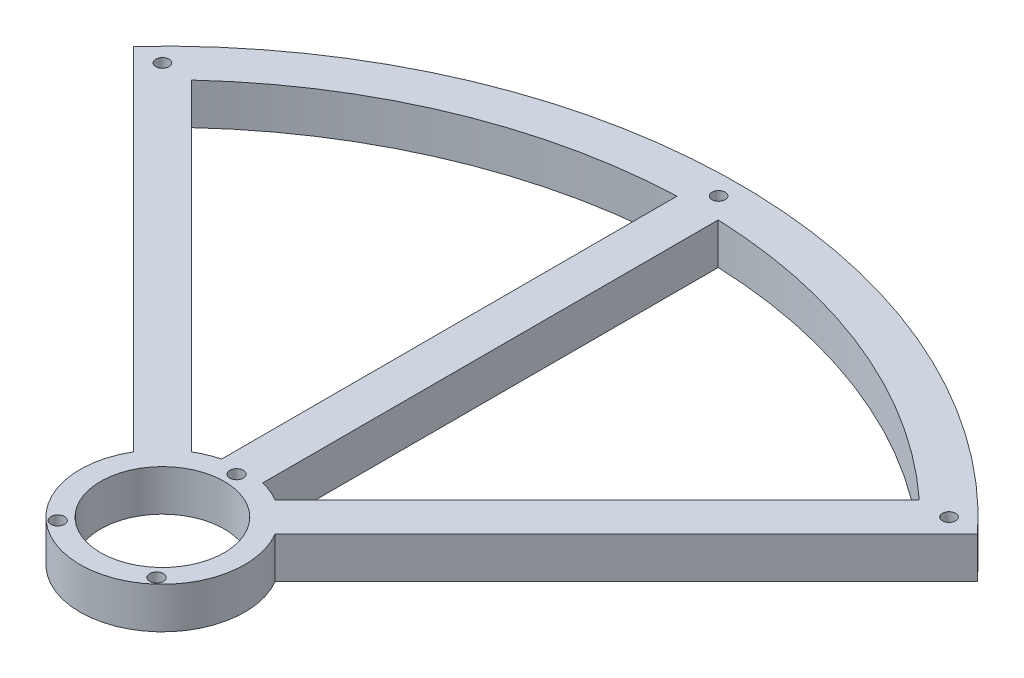
ISO-10303-21;
HEADER;
FILE_DESCRIPTION(('STEP AP214'),'2;1');
FILE_NAME('part.step','',(''),(''),'','','');
FILE_SCHEMA(('AUTOMOTIVE_DESIGN { 1 0 10303 214 1 1 1 1 }'));
ENDSEC;
DATA;
#1=APPLICATION_CONTEXT('core data for automotive mechanical design processes');
#2=APPLICATION_PROTOCOL_DEFINITION('international standard','automotive_design',2000,#1);
#3=PRODUCT_CONTEXT('',#1,'mechanical');
#4=PRODUCT('Part','Part','',(#3));
#5=PRODUCT_RELATED_PRODUCT_CATEGORY('part','',(#4));
#6=PRODUCT_DEFINITION_FORMATION('','',#4);
#7=PRODUCT_DEFINITION_CONTEXT('part definition',#1,'design');
#8=PRODUCT_DEFINITION('design','',#6,#7);
#9=PRODUCT_DEFINITION_SHAPE('','',#8);
#10=(LENGTH_UNIT() NAMED_UNIT(*) SI_UNIT(.MILLI.,.METRE.));
#11=(NAMED_UNIT(*) PLANE_ANGLE_UNIT() SI_UNIT($,.RADIAN.));
#12=(NAMED_UNIT(*) SI_UNIT($,.STERADIAN.) SOLID_ANGLE_UNIT());
#13=UNCERTAINTY_MEASURE_WITH_UNIT(LENGTH_MEASURE(1.E-05),#10,'distance_accuracy_value','');
#14=(GEOMETRIC_REPRESENTATION_CONTEXT(3) GLOBAL_UNCERTAINTY_ASSIGNED_CONTEXT((#13)) GLOBAL_UNIT_ASSIGNED_CONTEXT((#10,
#11,#12)) REPRESENTATION_CONTEXT('',''));
#15=CARTESIAN_POINT('',(0.,0.,0.));
#16=DIRECTION('',(0.,0.,1.));
#17=DIRECTION('',(1.,0.,0.));
#18=AXIS2_PLACEMENT_3D('',#15,#16,#17);
#19=CARTESIAN_POINT('',(0.,10.,0.));
#20=DIRECTION('',(0.,-1.,0.));
#21=DIRECTION('',(0.,0.,-1.));
#22=AXIS2_PLACEMENT_3D('',#19,#20,#21);
#23=CYLINDRICAL_SURFACE('',#22,20.);
#24=CARTESIAN_POINT('',(0.,0.,0.));
#25=DIRECTION('',(0.,1.,0.));
#26=DIRECTION('',(0.,0.,1.));
#27=AXIS2_PLACEMENT_3D('',#24,#25,#26);
#28=CIRCLE('',#27,20.);
#29=CARTESIAN_POINT('',(-17.2285978435619,0.,-10.1575300316964));
#30=VERTEX_POINT('',#29);
#31=CARTESIAN_POINT('',(17.2285978435619,0.,-10.1575300316964));
#32=VERTEX_POINT('',#31);
#33=EDGE_CURVE('E169',#30,#32,#28,.T.);
#34=ORIENTED_EDGE('',*,*,#33,.T.);
#35=DIRECTION('',(0.,-1.,0.));
#36=VECTOR('',#35,1.);
#37=CARTESIAN_POINT('',(17.2285978435619,10.,-10.1575300316964));
#38=LINE('',#37,#36);
#39=CARTESIAN_POINT('',(17.2285978435619,10.,-10.1575300316964));
#40=VERTEX_POINT('',#39);
#41=EDGE_CURVE('E11',#40,#32,#38,.T.);
#42=ORIENTED_EDGE('',*,*,#41,.F.);
#43=CARTESIAN_POINT('',(0.,10.,0.));
#44=DIRECTION('',(0.,1.,0.));
#45=DIRECTION('',(0.,0.,1.));
#46=AXIS2_PLACEMENT_3D('',#43,#44,#45);
#47=CIRCLE('',#46,20.);
#48=CARTESIAN_POINT('',(-17.2285978435619,10.,-10.1575300316964));
#49=VERTEX_POINT('',#48);
#50=EDGE_CURVE('E138',#49,#40,#47,.T.);
#51=ORIENTED_EDGE('',*,*,#50,.F.);
#52=DIRECTION('',(0.,-1.,0.));
#53=VECTOR('',#52,1.);
#54=CARTESIAN_POINT('',(-17.2285978435619,10.,-10.1575300316964));
#55=LINE('',#54,#53);
#56=EDGE_CURVE('E192',#49,#30,#55,.T.);
#57=ORIENTED_EDGE('',*,*,#56,.T.);
#58=EDGE_LOOP('',(#34,#42,#51,#57));
#59=FACE_BOUND('',#58,.T.);
#60=ADVANCED_FACE('F37',(#59),#23,.T.);
#61=CARTESIAN_POINT('',(3.53553390593275,10.,3.53553390593276));
#62=DIRECTION('',(-0.707106781186546,0.,-0.707106781186549));
#63=DIRECTION('',(-0.707106781186549,0.,0.707106781186546));
#64=AXIS2_PLACEMENT_3D('',#61,#62,#63);
#65=PLANE('',#64);
#66=DIRECTION('',(0.707106781186549,0.,-0.707106781186546));
#67=VECTOR('',#66,1.);
#68=CARTESIAN_POINT('',(3.53553390593275,0.,3.53553390593276));
#69=LINE('',#68,#67);
#70=CARTESIAN_POINT('',(102.46732859298,0.,-95.396260781114));
#71=VERTEX_POINT('',#70);
#72=EDGE_CURVE('E144',#32,#71,#69,.T.);
#73=ORIENTED_EDGE('',*,*,#72,.T.);
#74=DIRECTION('',(0.,-1.,0.));
#75=VECTOR('',#74,1.);
#76=CARTESIAN_POINT('',(102.46732859298,10.,-95.396260781114));
#77=LINE('',#76,#75);
#78=CARTESIAN_POINT('',(102.46732859298,10.,-95.396260781114));
#79=VERTEX_POINT('',#78);
#80=EDGE_CURVE('E47',#79,#71,#77,.T.);
#81=ORIENTED_EDGE('',*,*,#80,.F.);
#82=DIRECTION('',(0.707106781186549,0.,-0.707106781186546));
#83=VECTOR('',#82,1.);
#84=CARTESIAN_POINT('',(3.53553390593275,10.,3.53553390593276));
#85=LINE('',#84,#83);
#86=EDGE_CURVE('E132',#40,#79,#85,.T.);
#87=ORIENTED_EDGE('',*,*,#86,.F.);
#88=ORIENTED_EDGE('',*,*,#41,.T.);
#89=EDGE_LOOP('',(#73,#81,#87,#88));
#90=FACE_BOUND('',#89,.T.);
#91=ADVANCED_FACE('F143',(#90),#65,.F.);
#92=CARTESIAN_POINT('',(0.,10.,0.));
#93=DIRECTION('',(0.,-1.,0.));
#94=DIRECTION('',(0.,0.,-1.));
#95=AXIS2_PLACEMENT_3D('',#92,#93,#94);
#96=CYLINDRICAL_SURFACE('',#95,140.);
#97=CARTESIAN_POINT('',(0.,0.,0.));
#98=DIRECTION('',(0.,1.,0.));
#99=DIRECTION('',(0.,0.,1.));
#100=AXIS2_PLACEMENT_3D('',#97,#98,#99);
#101=CIRCLE('',#100,140.);
#102=CARTESIAN_POINT('',(-102.46732859298,0.,-95.396260781114));
#103=VERTEX_POINT('',#102);
#104=EDGE_CURVE('E188',#103,#71,#101,.F.);
#105=ORIENTED_EDGE('',*,*,#104,.F.);
#106=DIRECTION('',(0.,-1.,0.));
#107=VECTOR('',#106,1.);
#108=CARTESIAN_POINT('',(-102.46732859298,10.,-95.396260781114));
#109=LINE('',#108,#107);
#110=CARTESIAN_POINT('',(-102.46732859298,10.,-95.396260781114));
#111=VERTEX_POINT('',#110);
#112=EDGE_CURVE('E96',#111,#103,#109,.T.);
#113=ORIENTED_EDGE('',*,*,#112,.F.);
#114=CARTESIAN_POINT('',(0.,10.,0.));
#115=DIRECTION('',(0.,1.,0.));
#116=DIRECTION('',(0.,0.,1.));
#117=AXIS2_PLACEMENT_3D('',#114,#115,#116);
#118=CIRCLE('',#117,140.);
#119=EDGE_CURVE('E136',#111,#79,#118,.F.);
#120=ORIENTED_EDGE('',*,*,#119,.T.);
#121=ORIENTED_EDGE('',*,*,#80,.T.);
#122=EDGE_LOOP('',(#105,#113,#120,#121));
#123=FACE_BOUND('',#122,.T.);
#124=ADVANCED_FACE('F149',(#123),#96,.T.);
#125=CARTESIAN_POINT('',(0.,10.,0.));
#126=DIRECTION('',(0.,-1.,0.));
#127=DIRECTION('',(0.,0.,-1.));
#128=AXIS2_PLACEMENT_3D('',#125,#126,#127);
#129=CYLINDRICAL_SURFACE('',#128,130.);
#130=CARTESIAN_POINT('',(0.,0.,0.));
#131=DIRECTION('',(0.,1.,0.));
#132=DIRECTION('',(0.,0.,1.));
#133=AXIS2_PLACEMENT_3D('',#130,#131,#132);
#134=CIRCLE('',#133,130.);
#135=CARTESIAN_POINT('',(-88.3203314484366,0.,-95.3913992603018));
#136=VERTEX_POINT('',#135);
#137=CARTESIAN_POINT('',(-5.,0.,-129.903810567666));
#138=VERTEX_POINT('',#137);
#139=EDGE_CURVE('E163',#136,#138,#134,.F.);
#140=ORIENTED_EDGE('',*,*,#139,.T.);
#141=DIRECTION('',(0.,-1.,0.));
#142=VECTOR('',#141,1.);
#143=CARTESIAN_POINT('',(-5.,10.,-129.903810567666));
#144=LINE('',#143,#142);
#145=CARTESIAN_POINT('',(-5.,10.,-129.903810567666));
#146=VERTEX_POINT('',#145);
#147=EDGE_CURVE('E194',#146,#138,#144,.T.);
#148=ORIENTED_EDGE('',*,*,#147,.F.);
#149=CARTESIAN_POINT('',(0.,10.,0.));
#150=DIRECTION('',(0.,1.,0.));
#151=DIRECTION('',(0.,0.,1.));
#152=AXIS2_PLACEMENT_3D('',#149,#150,#151);
#153=CIRCLE('',#152,130.);
#154=CARTESIAN_POINT('',(-88.3203314484366,10.,-95.3913992603018));
#155=VERTEX_POINT('',#154);
#156=EDGE_CURVE('E232',#155,#146,#153,.F.);
#157=ORIENTED_EDGE('',*,*,#156,.F.);
#158=DIRECTION('',(0.,-1.,0.));
#159=VECTOR('',#158,1.);
#160=CARTESIAN_POINT('',(-88.3203314484366,10.,-95.3913992603018));
#161=LINE('',#160,#159);
#162=EDGE_CURVE('E196',#155,#136,#161,.T.);
#163=ORIENTED_EDGE('',*,*,#162,.T.);
#164=EDGE_LOOP('',(#140,#148,#157,#163));
#165=FACE_BOUND('',#164,.T.);
#166=ADVANCED_FACE('F274',(#165),#129,.F.);
#167=CARTESIAN_POINT('',(-5.,10.,0.));
#168=DIRECTION('',(1.,0.,0.));
#169=DIRECTION('',(0.,0.,-1.));
#170=AXIS2_PLACEMENT_3D('',#167,#168,#169);
#171=PLANE('',#170);
#172=DIRECTION('',(0.,0.,1.));
#173=VECTOR('',#172,1.);
#174=CARTESIAN_POINT('',(-5.,0.,0.));
#175=LINE('',#174,#173);
#176=CARTESIAN_POINT('',(-5.,0.,-19.3649167310371));
#177=VERTEX_POINT('',#176);
#178=EDGE_CURVE('E171',#138,#177,#175,.T.);
#179=ORIENTED_EDGE('',*,*,#178,.T.);
#180=DIRECTION('',(0.,-1.,0.));
#181=VECTOR('',#180,1.);
#182=CARTESIAN_POINT('',(-5.,10.,-19.3649167310371));
#183=LINE('',#182,#181);
#184=CARTESIAN_POINT('',(-5.,10.,-19.3649167310371));
#185=VERTEX_POINT('',#184);
#186=EDGE_CURVE('E202',#185,#177,#183,.T.);
#187=ORIENTED_EDGE('',*,*,#186,.F.);
#188=DIRECTION('',(0.,0.,1.));
#189=VECTOR('',#188,1.);
#190=CARTESIAN_POINT('',(-5.,10.,0.));
#191=LINE('',#190,#189);
#192=EDGE_CURVE('E240',#146,#185,#191,.T.);
#193=ORIENTED_EDGE('',*,*,#192,.F.);
#194=ORIENTED_EDGE('',*,*,#147,.T.);
#195=EDGE_LOOP('',(#179,#187,#193,#194));
#196=FACE_BOUND('',#195,.T.);
#197=ADVANCED_FACE('F276',(#196),#171,.F.);
#198=CARTESIAN_POINT('',(-10.1575300316965,0.,-17.2285978435619));
#199=VERTEX_POINT('',#198);
#200=EDGE_CURVE('E170',#177,#199,#28,.T.);
#201=ORIENTED_EDGE('',*,*,#200,.T.);
#202=DIRECTION('',(0.,-1.,0.));
#203=VECTOR('',#202,1.);
#204=CARTESIAN_POINT('',(-10.1575300316965,10.,-17.2285978435619));
#205=LINE('',#204,#203);
#206=CARTESIAN_POINT('',(-10.1575300316965,10.,-17.2285978435619));
#207=VERTEX_POINT('',#206);
#208=EDGE_CURVE('E199',#207,#199,#205,.T.);
#209=ORIENTED_EDGE('',*,*,#208,.F.);
#210=EDGE_CURVE('E234',#185,#207,#47,.T.);
#211=ORIENTED_EDGE('',*,*,#210,.F.);
#212=ORIENTED_EDGE('',*,*,#186,.T.);
#213=EDGE_LOOP('',(#201,#209,#211,#212));
#214=FACE_BOUND('',#213,.T.);
#215=ADVANCED_FACE('F264',(#214),#23,.T.);
#216=CARTESIAN_POINT('',(5.,10.,0.));
#217=DIRECTION('',(1.,0.,0.));
#218=DIRECTION('',(0.,0.,-1.));
#219=AXIS2_PLACEMENT_3D('',#216,#217,#218);
#220=PLANE('',#219);
#221=DIRECTION('',(0.,0.,1.));
#222=VECTOR('',#221,1.);
#223=CARTESIAN_POINT('',(5.,0.,0.));
#224=LINE('',#223,#222);
#225=CARTESIAN_POINT('',(5.,0.,-129.903810567666));
#226=VERTEX_POINT('',#225);
#227=CARTESIAN_POINT('',(5.,0.,-19.3649167310371));
#228=VERTEX_POINT('',#227);
#229=EDGE_CURVE('E155',#226,#228,#224,.T.);
#230=ORIENTED_EDGE('',*,*,#229,.F.);
#231=DIRECTION('',(0.,-1.,0.));
#232=VECTOR('',#231,1.);
#233=CARTESIAN_POINT('',(5.,10.,-129.903810567666));
#234=LINE('',#233,#232);
#235=CARTESIAN_POINT('',(5.,10.,-129.903810567666));
#236=VERTEX_POINT('',#235);
#237=EDGE_CURVE('E41',#236,#226,#234,.T.);
#238=ORIENTED_EDGE('',*,*,#237,.F.);
#239=DIRECTION('',(0.,0.,1.));
#240=VECTOR('',#239,1.);
#241=CARTESIAN_POINT('',(5.,10.,0.));
#242=LINE('',#241,#240);
#243=CARTESIAN_POINT('',(5.,10.,-19.3649167310371));
#244=VERTEX_POINT('',#243);
#245=EDGE_CURVE('E191',#236,#244,#242,.T.);
#246=ORIENTED_EDGE('',*,*,#245,.T.);
#247=DIRECTION('',(0.,-1.,0.));
#248=VECTOR('',#247,1.);
#249=CARTESIAN_POINT('',(5.,10.,-19.3649167310371));
#250=LINE('',#249,#248);
#251=EDGE_CURVE('E151',#244,#228,#250,.T.);
#252=ORIENTED_EDGE('',*,*,#251,.T.);
#253=EDGE_LOOP('',(#230,#238,#246,#252));
#254=FACE_BOUND('',#253,.T.);
#255=ADVANCED_FACE('F39',(#254),#220,.T.);
#256=CARTESIAN_POINT('',(88.3203314484366,0.,-95.3913992603018));
#257=VERTEX_POINT('',#256);
#258=EDGE_CURVE('E158',#226,#257,#134,.F.);
#259=ORIENTED_EDGE('',*,*,#258,.T.);
#260=DIRECTION('',(0.,-1.,0.));
#261=VECTOR('',#260,1.);
#262=CARTESIAN_POINT('',(88.3203314484366,10.,-95.3913992603018));
#263=LINE('',#262,#261);
#264=CARTESIAN_POINT('',(88.3203314484366,10.,-95.3913992603018));
#265=VERTEX_POINT('',#264);
#266=EDGE_CURVE('E209',#265,#257,#263,.T.);
#267=ORIENTED_EDGE('',*,*,#266,.F.);
#268=EDGE_CURVE('E217',#236,#265,#153,.F.);
#269=ORIENTED_EDGE('',*,*,#268,.F.);
#270=ORIENTED_EDGE('',*,*,#237,.T.);
#271=EDGE_LOOP('',(#259,#267,#269,#270));
#272=FACE_BOUND('',#271,.T.);
#273=ADVANCED_FACE('F216',(#272),#129,.F.);
#274=CARTESIAN_POINT('',(-3.53553390593271,10.,-3.53553390593272));
#275=DIRECTION('',(-0.707106781186546,0.,-0.707106781186549));
#276=DIRECTION('',(-0.707106781186549,0.,0.707106781186546));
#277=AXIS2_PLACEMENT_3D('',#274,#275,#276);
#278=PLANE('',#277);
#279=DIRECTION('',(0.707106781186549,0.,-0.707106781186546));
#280=VECTOR('',#279,1.);
#281=CARTESIAN_POINT('',(-3.53553390593271,0.,-3.53553390593272));
#282=LINE('',#281,#280);
#283=CARTESIAN_POINT('',(10.1575300316965,0.,-17.2285978435619));
#284=VERTEX_POINT('',#283);
#285=EDGE_CURVE('E162',#284,#257,#282,.T.);
#286=ORIENTED_EDGE('',*,*,#285,.F.);
#287=DIRECTION('',(0.,-1.,0.));
#288=VECTOR('',#287,1.);
#289=CARTESIAN_POINT('',(10.1575300316965,10.,-17.2285978435619));
#290=LINE('',#289,#288);
#291=CARTESIAN_POINT('',(10.1575300316965,10.,-17.2285978435619));
#292=VERTEX_POINT('',#291);
#293=EDGE_CURVE('E208',#292,#284,#290,.T.);
#294=ORIENTED_EDGE('',*,*,#293,.F.);
#295=DIRECTION('',(0.707106781186549,0.,-0.707106781186546));
#296=VECTOR('',#295,1.);
#297=CARTESIAN_POINT('',(-3.53553390593271,10.,-3.53553390593272));
#298=LINE('',#297,#296);
#299=EDGE_CURVE('E229',#292,#265,#298,.T.);
#300=ORIENTED_EDGE('',*,*,#299,.T.);
#301=ORIENTED_EDGE('',*,*,#266,.T.);
#302=EDGE_LOOP('',(#286,#294,#300,#301));
#303=FACE_BOUND('',#302,.T.);
#304=ADVANCED_FACE('F227',(#303),#278,.T.);
#305=CARTESIAN_POINT('',(0.,10.,0.));
#306=DIRECTION('',(0.,-1.,0.));
#307=DIRECTION('',(0.,0.,-1.));
#308=AXIS2_PLACEMENT_3D('',#305,#306,#307);
#309=CYLINDRICAL_SURFACE('',#308,15.);
#310=CARTESIAN_POINT('',(0.,10.,0.));
#311=DIRECTION('',(0.,1.,0.));
#312=DIRECTION('',(0.,0.,1.));
#313=AXIS2_PLACEMENT_3D('',#310,#311,#312);
#314=CIRCLE('',#313,15.);
#315=CARTESIAN_POINT('',(0.,10.,15.));
#316=VERTEX_POINT('',#315);
#317=EDGE_CURVE('E252',#316,#316,#314,.T.);
#318=ORIENTED_EDGE('',*,*,#317,.T.);
#319=EDGE_LOOP('',(#318));
#320=FACE_BOUND('',#319,.T.);
#321=CARTESIAN_POINT('',(0.,0.,0.));
#322=DIRECTION('',(0.,1.,0.));
#323=DIRECTION('',(0.,0.,1.));
#324=AXIS2_PLACEMENT_3D('',#321,#322,#323);
#325=CIRCLE('',#324,15.);
#326=CARTESIAN_POINT('',(0.,0.,15.));
#327=VERTEX_POINT('',#326);
#328=EDGE_CURVE('E184',#327,#327,#325,.T.);
#329=ORIENTED_EDGE('',*,*,#328,.F.);
#330=EDGE_LOOP('',(#329));
#331=FACE_BOUND('',#330,.T.);
#332=ADVANCED_FACE('F320',(#320,#331),#309,.F.);
#333=CARTESIAN_POINT('',(0.,10.,-18.));
#334=DIRECTION('',(0.,-1.,0.));
#335=DIRECTION('',(0.,0.,-1.));
#336=AXIS2_PLACEMENT_3D('',#333,#334,#335);
#337=CYLINDRICAL_SURFACE('',#336,1.65);
#338=CARTESIAN_POINT('',(0.,10.,-18.));
#339=DIRECTION('',(0.,1.,0.));
#340=DIRECTION('',(0.,0.,1.));
#341=AXIS2_PLACEMENT_3D('',#338,#339,#340);
#342=CIRCLE('',#341,1.65);
#343=CARTESIAN_POINT('',(0.,10.,-16.35));
#344=VERTEX_POINT('',#343);
#345=EDGE_CURVE('E250',#344,#344,#342,.T.);
#346=ORIENTED_EDGE('',*,*,#345,.T.);
#347=EDGE_LOOP('',(#346));
#348=FACE_BOUND('',#347,.T.);
#349=CARTESIAN_POINT('',(0.,0.,-18.));
#350=DIRECTION('',(0.,1.,0.));
#351=DIRECTION('',(0.,0.,1.));
#352=AXIS2_PLACEMENT_3D('',#349,#350,#351);
#353=CIRCLE('',#352,1.65);
#354=CARTESIAN_POINT('',(0.,0.,-16.35));
#355=VERTEX_POINT('',#354);
#356=EDGE_CURVE('E181',#355,#355,#353,.T.);
#357=ORIENTED_EDGE('',*,*,#356,.F.);
#358=EDGE_LOOP('',(#357));
#359=FACE_BOUND('',#358,.T.);
#360=ADVANCED_FACE('F325',(#348,#359),#337,.F.);
#361=CARTESIAN_POINT('',(-12.,10.,13.4164078649987));
#362=DIRECTION('',(0.,-1.,0.));
#363=DIRECTION('',(0.,0.,-1.));
#364=AXIS2_PLACEMENT_3D('',#361,#362,#363);
#365=CYLINDRICAL_SURFACE('',#364,1.65);
#366=CARTESIAN_POINT('',(-12.,10.,13.4164078649987));
#367=DIRECTION('',(0.,1.,0.));
#368=DIRECTION('',(0.,0.,1.));
#369=AXIS2_PLACEMENT_3D('',#366,#367,#368);
#370=CIRCLE('',#369,1.65);
#371=CARTESIAN_POINT('',(-12.,10.,15.0664078649987));
#372=VERTEX_POINT('',#371);
#373=EDGE_CURVE('E247',#372,#372,#370,.T.);
#374=ORIENTED_EDGE('',*,*,#373,.T.);
#375=EDGE_LOOP('',(#374));
#376=FACE_BOUND('',#375,.T.);
#377=CARTESIAN_POINT('',(-12.,0.,13.4164078649987));
#378=DIRECTION('',(0.,1.,0.));
#379=DIRECTION('',(0.,0.,1.));
#380=AXIS2_PLACEMENT_3D('',#377,#378,#379);
#381=CIRCLE('',#380,1.65);
#382=CARTESIAN_POINT('',(-12.,0.,15.0664078649987));
#383=VERTEX_POINT('',#382);
#384=EDGE_CURVE('E178',#383,#383,#381,.T.);
#385=ORIENTED_EDGE('',*,*,#384,.F.);
#386=EDGE_LOOP('',(#385));
#387=FACE_BOUND('',#386,.T.);
#388=ADVANCED_FACE('F475',(#376,#387),#365,.F.);
#389=CARTESIAN_POINT('',(12.,10.,13.4164078649987));
#390=DIRECTION('',(0.,-1.,0.));
#391=DIRECTION('',(0.,0.,-1.));
#392=AXIS2_PLACEMENT_3D('',#389,#390,#391);
#393=CYLINDRICAL_SURFACE('',#392,1.65);
#394=CARTESIAN_POINT('',(12.,10.,13.4164078649987));
#395=DIRECTION('',(0.,1.,0.));
#396=DIRECTION('',(0.,0.,1.));
#397=AXIS2_PLACEMENT_3D('',#394,#395,#396);
#398=CIRCLE('',#397,1.65);
#399=CARTESIAN_POINT('',(12.,10.,15.0664078649987));
#400=VERTEX_POINT('',#399);
#401=EDGE_CURVE('E244',#400,#400,#398,.F.);
#402=ORIENTED_EDGE('',*,*,#401,.F.);
#403=EDGE_LOOP('',(#402));
#404=FACE_BOUND('',#403,.T.);
#405=CARTESIAN_POINT('',(12.,0.,13.4164078649987));
#406=DIRECTION('',(0.,1.,0.));
#407=DIRECTION('',(0.,0.,1.));
#408=AXIS2_PLACEMENT_3D('',#405,#406,#407);
#409=CIRCLE('',#408,1.65);
#410=CARTESIAN_POINT('',(12.,0.,15.0664078649987));
#411=VERTEX_POINT('',#410);
#412=EDGE_CURVE('E175',#411,#411,#409,.F.);
#413=ORIENTED_EDGE('',*,*,#412,.T.);
#414=EDGE_LOOP('',(#413));
#415=FACE_BOUND('',#414,.T.);
#416=ADVANCED_FACE('F468',(#404,#415),#393,.F.);
#417=CARTESIAN_POINT('',(3.53553390593271,10.,-3.53553390593272));
#418=DIRECTION('',(-0.707106781186546,0.,0.707106781186549));
#419=DIRECTION('',(0.707106781186549,0.,0.707106781186546));
#420=AXIS2_PLACEMENT_3D('',#417,#418,#419);
#421=PLANE('',#420);
#422=DIRECTION('',(-0.707106781186549,0.,-0.707106781186546));
#423=VECTOR('',#422,1.);
#424=CARTESIAN_POINT('',(3.53553390593271,0.,-3.53553390593272));
#425=LINE('',#424,#423);
#426=EDGE_CURVE('E173',#199,#136,#425,.T.);
#427=ORIENTED_EDGE('',*,*,#426,.T.);
#428=ORIENTED_EDGE('',*,*,#162,.F.);
#429=DIRECTION('',(-0.707106781186549,0.,-0.707106781186546));
#430=VECTOR('',#429,1.);
#431=CARTESIAN_POINT('',(3.53553390593271,10.,-3.53553390593272));
#432=LINE('',#431,#430);
#433=EDGE_CURVE('E242',#207,#155,#432,.T.);
#434=ORIENTED_EDGE('',*,*,#433,.F.);
#435=ORIENTED_EDGE('',*,*,#208,.T.);
#436=EDGE_LOOP('',(#427,#428,#434,#435));
#437=FACE_BOUND('',#436,.T.);
#438=ADVANCED_FACE('F268',(#437),#421,.F.);
#439=EDGE_CURVE('E166',#284,#228,#28,.T.);
#440=ORIENTED_EDGE('',*,*,#439,.T.);
#441=ORIENTED_EDGE('',*,*,#251,.F.);
#442=EDGE_CURVE('E230',#292,#244,#47,.T.);
#443=ORIENTED_EDGE('',*,*,#442,.F.);
#444=ORIENTED_EDGE('',*,*,#293,.T.);
#445=EDGE_LOOP('',(#440,#441,#443,#444));
#446=FACE_BOUND('',#445,.T.);
#447=ADVANCED_FACE('F226',(#446),#23,.T.);
#448=CARTESIAN_POINT('',(-3.53553390593263,10.,3.53553390593265));
#449=DIRECTION('',(0.707106781186545,0.,-0.70710678118655));
#450=DIRECTION('',(-0.70710678118655,0.,-0.707106781186545));
#451=AXIS2_PLACEMENT_3D('',#448,#449,#450);
#452=PLANE('',#451);
#453=DIRECTION('',(0.70710678118655,0.,0.707106781186545));
#454=VECTOR('',#453,1.);
#455=CARTESIAN_POINT('',(-3.53553390593263,0.,3.53553390593265));
#456=LINE('',#455,#454);
#457=EDGE_CURVE('E99',#103,#30,#456,.T.);
#458=ORIENTED_EDGE('',*,*,#457,.T.);
#459=ORIENTED_EDGE('',*,*,#56,.F.);
#460=DIRECTION('',(0.70710678118655,0.,0.707106781186545));
#461=VECTOR('',#460,1.);
#462=CARTESIAN_POINT('',(-3.53553390593263,10.,3.53553390593265));
#463=LINE('',#462,#461);
#464=EDGE_CURVE('E56',#111,#49,#463,.T.);
#465=ORIENTED_EDGE('',*,*,#464,.F.);
#466=ORIENTED_EDGE('',*,*,#112,.T.);
#467=EDGE_LOOP('',(#458,#459,#465,#466));
#468=FACE_BOUND('',#467,.T.);
#469=ADVANCED_FACE('F293',(#468),#452,.F.);
#470=CARTESIAN_POINT('',(0.,10.,0.));
#471=DIRECTION('',(0.,1.,0.));
#472=DIRECTION('',(0.,0.,1.));
#473=AXIS2_PLACEMENT_3D('',#470,#471,#472);
#474=PLANE('',#473);
#475=CARTESIAN_POINT('',(0.,10.,-135.));
#476=DIRECTION('',(0.,1.,0.));
#477=DIRECTION('',(0.,0.,1.));
#478=AXIS2_PLACEMENT_3D('',#475,#476,#477);
#479=CIRCLE('',#478,1.59999999999999);
#480=CARTESIAN_POINT('',(0.,10.,-133.4));
#481=VERTEX_POINT('',#480);
#482=EDGE_CURVE('E422',#481,#481,#479,.T.);
#483=ORIENTED_EDGE('',*,*,#482,.F.);
#484=EDGE_LOOP('',(#483));
#485=FACE_BOUND('',#484,.T.);
#486=CARTESIAN_POINT('',(95.4594154601839,10.,-95.4594154601839));
#487=DIRECTION('',(0.,1.,0.));
#488=DIRECTION('',(0.,0.,-1.));
#489=AXIS2_PLACEMENT_3D('',#486,#487,#488);
#490=CIRCLE('',#489,1.60000000000001);
#491=CARTESIAN_POINT('',(95.4594154601839,10.,-97.0594154601839));
#492=VERTEX_POINT('',#491);
#493=EDGE_CURVE('E428',#492,#492,#490,.T.);
#494=ORIENTED_EDGE('',*,*,#493,.F.);
#495=EDGE_LOOP('',(#494));
#496=FACE_BOUND('',#495,.T.);
#497=CARTESIAN_POINT('',(-95.4594154601839,10.,-95.4594154601839));
#498=DIRECTION('',(0.,1.,0.));
#499=DIRECTION('',(0.,0.,1.));
#500=AXIS2_PLACEMENT_3D('',#497,#498,#499);
#501=CIRCLE('',#500,1.60000000000001);
#502=CARTESIAN_POINT('',(-95.4594154601839,10.,-93.8594154601839));
#503=VERTEX_POINT('',#502);
#504=EDGE_CURVE('E425',#503,#503,#501,.T.);
#505=ORIENTED_EDGE('',*,*,#504,.F.);
#506=EDGE_LOOP('',(#505));
#507=FACE_BOUND('',#506,.T.);
#508=ORIENTED_EDGE('',*,*,#245,.F.);
#509=ORIENTED_EDGE('',*,*,#268,.T.);
#510=ORIENTED_EDGE('',*,*,#299,.F.);
#511=ORIENTED_EDGE('',*,*,#442,.T.);
#512=EDGE_LOOP('',(#508,#509,#510,#511));
#513=FACE_BOUND('',#512,.T.);
#514=ORIENTED_EDGE('',*,*,#156,.T.);
#515=ORIENTED_EDGE('',*,*,#192,.T.);
#516=ORIENTED_EDGE('',*,*,#210,.T.);
#517=ORIENTED_EDGE('',*,*,#433,.T.);
#518=EDGE_LOOP('',(#514,#515,#516,#517));
#519=FACE_BOUND('',#518,.T.);
#520=ORIENTED_EDGE('',*,*,#401,.T.);
#521=EDGE_LOOP('',(#520));
#522=FACE_BOUND('',#521,.T.);
#523=ORIENTED_EDGE('',*,*,#373,.F.);
#524=EDGE_LOOP('',(#523));
#525=FACE_BOUND('',#524,.T.);
#526=ORIENTED_EDGE('',*,*,#345,.F.);
#527=EDGE_LOOP('',(#526));
#528=FACE_BOUND('',#527,.T.);
#529=ORIENTED_EDGE('',*,*,#317,.F.);
#530=EDGE_LOOP('',(#529));
#531=FACE_BOUND('',#530,.T.);
#532=ORIENTED_EDGE('',*,*,#50,.T.);
#533=ORIENTED_EDGE('',*,*,#86,.T.);
#534=ORIENTED_EDGE('',*,*,#119,.F.);
#535=ORIENTED_EDGE('',*,*,#464,.T.);
#536=EDGE_LOOP('',(#532,#533,#534,#535));
#537=FACE_BOUND('',#536,.T.);
#538=ADVANCED_FACE('F134',(#485,#496,#507,#513,#519,#522,#525,#528,#531,#537),#474,.T.);
#539=CARTESIAN_POINT('',(0.,0.,0.));
#540=DIRECTION('',(0.,1.,0.));
#541=DIRECTION('',(0.,0.,1.));
#542=AXIS2_PLACEMENT_3D('',#539,#540,#541);
#543=PLANE('',#542);
#544=CARTESIAN_POINT('',(0.,0.,-135.));
#545=DIRECTION('',(0.,1.,0.));
#546=DIRECTION('',(0.,0.,1.));
#547=AXIS2_PLACEMENT_3D('',#544,#545,#546);
#548=CIRCLE('',#547,1.59999999999999);
#549=CARTESIAN_POINT('',(0.,0.,-133.4));
#550=VERTEX_POINT('',#549);
#551=EDGE_CURVE('E419',#550,#550,#548,.T.);
#552=ORIENTED_EDGE('',*,*,#551,.T.);
#553=EDGE_LOOP('',(#552));
#554=FACE_BOUND('',#553,.T.);
#555=CARTESIAN_POINT('',(95.4594154601839,0.,-95.4594154601839));
#556=DIRECTION('',(0.,1.,0.));
#557=DIRECTION('',(0.,0.,-1.));
#558=AXIS2_PLACEMENT_3D('',#555,#556,#557);
#559=CIRCLE('',#558,1.60000000000001);
#560=CARTESIAN_POINT('',(95.4594154601839,0.,-97.0594154601839));
#561=VERTEX_POINT('',#560);
#562=EDGE_CURVE('E423',#561,#561,#559,.T.);
#563=ORIENTED_EDGE('',*,*,#562,.T.);
#564=EDGE_LOOP('',(#563));
#565=FACE_BOUND('',#564,.T.);
#566=CARTESIAN_POINT('',(-95.4594154601839,0.,-95.4594154601839));
#567=DIRECTION('',(0.,1.,0.));
#568=DIRECTION('',(0.,0.,1.));
#569=AXIS2_PLACEMENT_3D('',#566,#567,#568);
#570=CIRCLE('',#569,1.60000000000001);
#571=CARTESIAN_POINT('',(-95.4594154601839,0.,-93.8594154601839));
#572=VERTEX_POINT('',#571);
#573=EDGE_CURVE('E159',#572,#572,#570,.T.);
#574=ORIENTED_EDGE('',*,*,#573,.T.);
#575=EDGE_LOOP('',(#574));
#576=FACE_BOUND('',#575,.T.);
#577=ORIENTED_EDGE('',*,*,#229,.T.);
#578=ORIENTED_EDGE('',*,*,#439,.F.);
#579=ORIENTED_EDGE('',*,*,#285,.T.);
#580=ORIENTED_EDGE('',*,*,#258,.F.);
#581=EDGE_LOOP('',(#577,#578,#579,#580));
#582=FACE_BOUND('',#581,.T.);
#583=ORIENTED_EDGE('',*,*,#139,.F.);
#584=ORIENTED_EDGE('',*,*,#426,.F.);
#585=ORIENTED_EDGE('',*,*,#200,.F.);
#586=ORIENTED_EDGE('',*,*,#178,.F.);
#587=EDGE_LOOP('',(#583,#584,#585,#586));
#588=FACE_BOUND('',#587,.T.);
#589=ORIENTED_EDGE('',*,*,#412,.F.);
#590=EDGE_LOOP('',(#589));
#591=FACE_BOUND('',#590,.T.);
#592=ORIENTED_EDGE('',*,*,#384,.T.);
#593=EDGE_LOOP('',(#592));
#594=FACE_BOUND('',#593,.T.);
#595=ORIENTED_EDGE('',*,*,#356,.T.);
#596=EDGE_LOOP('',(#595));
#597=FACE_BOUND('',#596,.T.);
#598=ORIENTED_EDGE('',*,*,#328,.T.);
#599=EDGE_LOOP('',(#598));
#600=FACE_BOUND('',#599,.T.);
#601=ORIENTED_EDGE('',*,*,#33,.F.);
#602=ORIENTED_EDGE('',*,*,#457,.F.);
#603=ORIENTED_EDGE('',*,*,#104,.T.);
#604=ORIENTED_EDGE('',*,*,#72,.F.);
#605=EDGE_LOOP('',(#601,#602,#603,#604));
#606=FACE_BOUND('',#605,.T.);
#607=ADVANCED_FACE('F220',(#554,#565,#576,#582,#588,#591,#594,#597,#600,#606),#543,.F.);
#608=CARTESIAN_POINT('',(-95.4594154601839,0.,-95.4594154601839));
#609=DIRECTION('',(0.,1.,0.));
#610=DIRECTION('',(0.,0.,1.));
#611=AXIS2_PLACEMENT_3D('',#608,#609,#610);
#612=CYLINDRICAL_SURFACE('',#611,1.60000000000001);
#613=ORIENTED_EDGE('',*,*,#573,.F.);
#614=EDGE_LOOP('',(#613));
#615=FACE_BOUND('',#614,.T.);
#616=ORIENTED_EDGE('',*,*,#504,.T.);
#617=EDGE_LOOP('',(#616));
#618=FACE_BOUND('',#617,.T.);
#619=ADVANCED_FACE('F283',(#615,#618),#612,.F.);
#620=CARTESIAN_POINT('',(95.4594154601839,0.,-95.4594154601839));
#621=DIRECTION('',(0.,1.,0.));
#622=DIRECTION('',(0.,0.,1.));
#623=AXIS2_PLACEMENT_3D('',#620,#621,#622);
#624=CYLINDRICAL_SURFACE('',#623,1.60000000000001);
#625=ORIENTED_EDGE('',*,*,#562,.F.);
#626=EDGE_LOOP('',(#625));
#627=FACE_BOUND('',#626,.T.);
#628=ORIENTED_EDGE('',*,*,#493,.T.);
#629=EDGE_LOOP('',(#628));
#630=FACE_BOUND('',#629,.T.);
#631=ADVANCED_FACE('F290',(#627,#630),#624,.F.);
#632=CARTESIAN_POINT('',(0.,0.,-135.));
#633=DIRECTION('',(0.,1.,0.));
#634=DIRECTION('',(0.,0.,1.));
#635=AXIS2_PLACEMENT_3D('',#632,#633,#634);
#636=CYLINDRICAL_SURFACE('',#635,1.59999999999999);
#637=ORIENTED_EDGE('',*,*,#551,.F.);
#638=EDGE_LOOP('',(#637));
#639=FACE_BOUND('',#638,.T.);
#640=ORIENTED_EDGE('',*,*,#482,.T.);
#641=EDGE_LOOP('',(#640));
#642=FACE_BOUND('',#641,.T.);
#643=ADVANCED_FACE('F403',(#639,#642),#636,.F.);
#644=CLOSED_SHELL('',(#60,#91,#124,#166,#197,#215,#255,#273,#304,#332,#360,#388,#416,#438,#447,
#469,#538,#607,#619,#631,#643));
#645=MANIFOLD_SOLID_BREP('B2',#644);
#646=ADVANCED_BREP_SHAPE_REPRESENTATION('',(#18,#645),#14);
#647=SHAPE_DEFINITION_REPRESENTATION(#9,#646);
ENDSEC;
END-ISO-10303-21;
